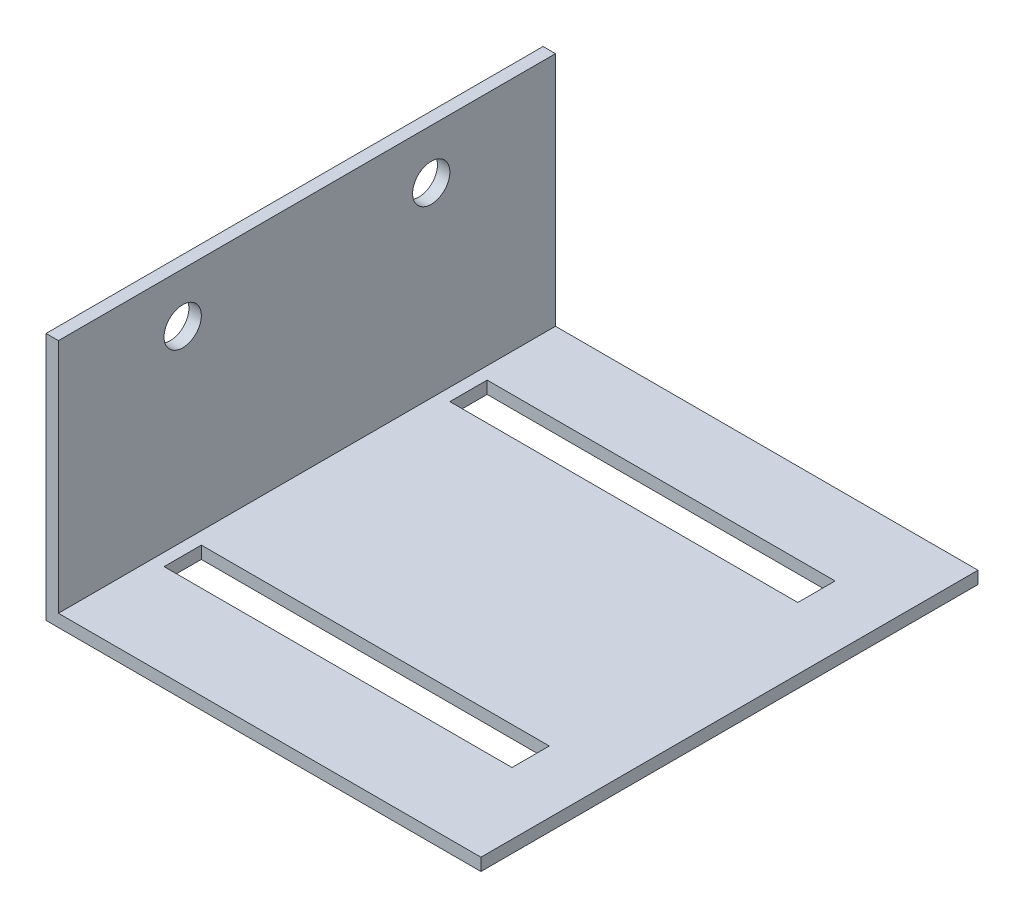
ISO-10303-21;
HEADER;
FILE_DESCRIPTION(('STEP AP214'),'2;1');
FILE_NAME('part.step','',(''),(''),'','','');
FILE_SCHEMA(('AUTOMOTIVE_DESIGN { 1 0 10303 214 1 1 1 1 }'));
ENDSEC;
DATA;
#1=APPLICATION_CONTEXT('core data for automotive mechanical design processes');
#2=APPLICATION_PROTOCOL_DEFINITION('international standard','automotive_design',2000,#1);
#3=PRODUCT_CONTEXT('',#1,'mechanical');
#4=PRODUCT('Part','Part','',(#3));
#5=PRODUCT_RELATED_PRODUCT_CATEGORY('part','',(#4));
#6=PRODUCT_DEFINITION_FORMATION('','',#4);
#7=PRODUCT_DEFINITION_CONTEXT('part definition',#1,'design');
#8=PRODUCT_DEFINITION('design','',#6,#7);
#9=PRODUCT_DEFINITION_SHAPE('','',#8);
#10=(LENGTH_UNIT() NAMED_UNIT(*) SI_UNIT(.MILLI.,.METRE.));
#11=(NAMED_UNIT(*) PLANE_ANGLE_UNIT() SI_UNIT($,.RADIAN.));
#12=(NAMED_UNIT(*) SI_UNIT($,.STERADIAN.) SOLID_ANGLE_UNIT());
#13=UNCERTAINTY_MEASURE_WITH_UNIT(LENGTH_MEASURE(1.E-05),#10,'distance_accuracy_value','');
#14=(GEOMETRIC_REPRESENTATION_CONTEXT(3) GLOBAL_UNCERTAINTY_ASSIGNED_CONTEXT((#13)) GLOBAL_UNIT_ASSIGNED_CONTEXT((#10,
#11,#12)) REPRESENTATION_CONTEXT('',''));
#15=CARTESIAN_POINT('',(0.,0.,0.));
#16=DIRECTION('',(0.,0.,1.));
#17=DIRECTION('',(1.,0.,0.));
#18=AXIS2_PLACEMENT_3D('',#15,#16,#17);
#19=CARTESIAN_POINT('',(0.,20.,40.));
#20=DIRECTION('',(1.,0.,0.));
#21=DIRECTION('',(0.,1.,0.));
#22=AXIS2_PLACEMENT_3D('',#19,#20,#21);
#23=PLANE('',#22);
#24=CARTESIAN_POINT('',(0.,16.,30.));
#25=DIRECTION('',(-1.,0.,0.));
#26=DIRECTION('',(0.,-1.,0.));
#27=AXIS2_PLACEMENT_3D('',#24,#25,#26);
#28=CIRCLE('',#27,1.5);
#29=CARTESIAN_POINT('',(0.,14.5,30.));
#30=VERTEX_POINT('',#29);
#31=EDGE_CURVE('E247',#30,#30,#28,.T.);
#32=ORIENTED_EDGE('',*,*,#31,.F.);
#33=EDGE_LOOP('',(#32));
#34=FACE_BOUND('',#33,.T.);
#35=CARTESIAN_POINT('',(0.,16.,10.));
#36=DIRECTION('',(-1.,0.,0.));
#37=DIRECTION('',(0.,-1.,0.));
#38=AXIS2_PLACEMENT_3D('',#35,#36,#37);
#39=CIRCLE('',#38,1.5);
#40=CARTESIAN_POINT('',(0.,14.5,10.));
#41=VERTEX_POINT('',#40);
#42=EDGE_CURVE('E252',#41,#41,#39,.T.);
#43=ORIENTED_EDGE('',*,*,#42,.F.);
#44=EDGE_LOOP('',(#43));
#45=FACE_BOUND('',#44,.T.);
#46=DIRECTION('',(0.,-1.,0.));
#47=VECTOR('',#46,1.);
#48=CARTESIAN_POINT('',(0.,20.,0.));
#49=LINE('',#48,#47);
#50=CARTESIAN_POINT('',(0.,20.,0.));
#51=VERTEX_POINT('',#50);
#52=CARTESIAN_POINT('',(0.,0.,0.));
#53=VERTEX_POINT('',#52);
#54=EDGE_CURVE('E206',#51,#53,#49,.T.);
#55=ORIENTED_EDGE('',*,*,#54,.T.);
#56=DIRECTION('',(0.,0.,-1.));
#57=VECTOR('',#56,1.);
#58=CARTESIAN_POINT('',(0.,0.,40.));
#59=LINE('',#58,#57);
#60=CARTESIAN_POINT('',(0.,0.,40.));
#61=VERTEX_POINT('',#60);
#62=EDGE_CURVE('E11',#61,#53,#59,.T.);
#63=ORIENTED_EDGE('',*,*,#62,.F.);
#64=DIRECTION('',(0.,-1.,0.));
#65=VECTOR('',#64,1.);
#66=CARTESIAN_POINT('',(0.,20.,40.));
#67=LINE('',#66,#65);
#68=CARTESIAN_POINT('',(0.,20.,40.));
#69=VERTEX_POINT('',#68);
#70=EDGE_CURVE('E207',#69,#61,#67,.T.);
#71=ORIENTED_EDGE('',*,*,#70,.F.);
#72=DIRECTION('',(0.,0.,-1.));
#73=VECTOR('',#72,1.);
#74=CARTESIAN_POINT('',(0.,20.,40.));
#75=LINE('',#74,#73);
#76=EDGE_CURVE('E221',#69,#51,#75,.T.);
#77=ORIENTED_EDGE('',*,*,#76,.T.);
#78=EDGE_LOOP('',(#55,#63,#71,#77));
#79=FACE_BOUND('',#78,.T.);
#80=ADVANCED_FACE('F34',(#34,#45,#79),#23,.F.);
#81=CARTESIAN_POINT('',(0.,0.,40.));
#82=DIRECTION('',(0.,1.,0.));
#83=DIRECTION('',(0.,0.,1.));
#84=AXIS2_PLACEMENT_3D('',#81,#82,#83);
#85=PLANE('',#84);
#86=DIRECTION('',(-1.,0.,0.));
#87=VECTOR('',#86,1.);
#88=CARTESIAN_POINT('',(0.,0.,6.50000000000001));
#89=LINE('',#88,#87);
#90=CARTESIAN_POINT('',(30.,0.,6.50000000000002));
#91=VERTEX_POINT('',#90);
#92=CARTESIAN_POINT('',(2.,0.,6.50000000000002));
#93=VERTEX_POINT('',#92);
#94=EDGE_CURVE('E200',#91,#93,#89,.T.);
#95=ORIENTED_EDGE('',*,*,#94,.T.);
#96=DIRECTION('',(0.,0.,1.));
#97=VECTOR('',#96,1.);
#98=CARTESIAN_POINT('',(2.,0.,40.));
#99=LINE('',#98,#97);
#100=CARTESIAN_POINT('',(2.,0.,9.50000000000002));
#101=VERTEX_POINT('',#100);
#102=EDGE_CURVE('E203',#93,#101,#99,.T.);
#103=ORIENTED_EDGE('',*,*,#102,.T.);
#104=DIRECTION('',(1.,0.,0.));
#105=VECTOR('',#104,1.);
#106=CARTESIAN_POINT('',(0.,0.,9.50000000000002));
#107=LINE('',#106,#105);
#108=CARTESIAN_POINT('',(30.,0.,9.50000000000003));
#109=VERTEX_POINT('',#108);
#110=EDGE_CURVE('E197',#101,#109,#107,.T.);
#111=ORIENTED_EDGE('',*,*,#110,.T.);
#112=DIRECTION('',(0.,0.,-1.));
#113=VECTOR('',#112,1.);
#114=CARTESIAN_POINT('',(30.,0.,40.));
#115=LINE('',#114,#113);
#116=EDGE_CURVE('E141',#109,#91,#115,.T.);
#117=ORIENTED_EDGE('',*,*,#116,.T.);
#118=EDGE_LOOP('',(#95,#103,#111,#117));
#119=FACE_BOUND('',#118,.T.);
#120=DIRECTION('',(-1.,0.,0.));
#121=VECTOR('',#120,1.);
#122=CARTESIAN_POINT('',(0.,0.,29.5));
#123=LINE('',#122,#121);
#124=CARTESIAN_POINT('',(30.,0.,29.5));
#125=VERTEX_POINT('',#124);
#126=CARTESIAN_POINT('',(2.00000000000001,0.,29.5));
#127=VERTEX_POINT('',#126);
#128=EDGE_CURVE('E191',#125,#127,#123,.T.);
#129=ORIENTED_EDGE('',*,*,#128,.T.);
#130=DIRECTION('',(0.,0.,1.));
#131=VECTOR('',#130,1.);
#132=CARTESIAN_POINT('',(2.00000000000001,0.,40.));
#133=LINE('',#132,#131);
#134=CARTESIAN_POINT('',(2.00000000000001,0.,32.5));
#135=VERTEX_POINT('',#134);
#136=EDGE_CURVE('E194',#127,#135,#133,.T.);
#137=ORIENTED_EDGE('',*,*,#136,.T.);
#138=DIRECTION('',(1.,0.,0.));
#139=VECTOR('',#138,1.);
#140=CARTESIAN_POINT('',(0.,0.,32.5));
#141=LINE('',#140,#139);
#142=CARTESIAN_POINT('',(30.,0.,32.5));
#143=VERTEX_POINT('',#142);
#144=EDGE_CURVE('E165',#135,#143,#141,.T.);
#145=ORIENTED_EDGE('',*,*,#144,.T.);
#146=DIRECTION('',(0.,0.,-1.));
#147=VECTOR('',#146,1.);
#148=CARTESIAN_POINT('',(30.,0.,40.));
#149=LINE('',#148,#147);
#150=EDGE_CURVE('E188',#143,#125,#149,.T.);
#151=ORIENTED_EDGE('',*,*,#150,.T.);
#152=EDGE_LOOP('',(#129,#137,#145,#151));
#153=FACE_BOUND('',#152,.T.);
#154=DIRECTION('',(1.,0.,0.));
#155=VECTOR('',#154,1.);
#156=CARTESIAN_POINT('',(0.,0.,0.));
#157=LINE('',#156,#155);
#158=CARTESIAN_POINT('',(35.,0.,0.));
#159=VERTEX_POINT('',#158);
#160=EDGE_CURVE('E224',#53,#159,#157,.T.);
#161=ORIENTED_EDGE('',*,*,#160,.T.);
#162=DIRECTION('',(0.,0.,-1.));
#163=VECTOR('',#162,1.);
#164=CARTESIAN_POINT('',(35.,0.,40.));
#165=LINE('',#164,#163);
#166=CARTESIAN_POINT('',(35.,0.,40.));
#167=VERTEX_POINT('',#166);
#168=EDGE_CURVE('E42',#167,#159,#165,.T.);
#169=ORIENTED_EDGE('',*,*,#168,.F.);
#170=DIRECTION('',(1.,0.,0.));
#171=VECTOR('',#170,1.);
#172=CARTESIAN_POINT('',(0.,0.,40.));
#173=LINE('',#172,#171);
#174=EDGE_CURVE('E210',#61,#167,#173,.T.);
#175=ORIENTED_EDGE('',*,*,#174,.F.);
#176=ORIENTED_EDGE('',*,*,#62,.T.);
#177=EDGE_LOOP('',(#161,#169,#175,#176));
#178=FACE_BOUND('',#177,.T.);
#179=ADVANCED_FACE('F264',(#119,#153,#178),#85,.F.);
#180=CARTESIAN_POINT('',(35.,0.,40.));
#181=DIRECTION('',(-1.,0.,0.));
#182=DIRECTION('',(0.,0.,1.));
#183=AXIS2_PLACEMENT_3D('',#180,#181,#182);
#184=PLANE('',#183);
#185=DIRECTION('',(0.,1.,0.));
#186=VECTOR('',#185,1.);
#187=CARTESIAN_POINT('',(35.,0.,0.));
#188=LINE('',#187,#186);
#189=CARTESIAN_POINT('',(35.,1.,0.));
#190=VERTEX_POINT('',#189);
#191=EDGE_CURVE('E226',#159,#190,#188,.T.);
#192=ORIENTED_EDGE('',*,*,#191,.T.);
#193=DIRECTION('',(0.,0.,-1.));
#194=VECTOR('',#193,1.);
#195=CARTESIAN_POINT('',(35.,1.,40.));
#196=LINE('',#195,#194);
#197=CARTESIAN_POINT('',(35.,1.,40.));
#198=VERTEX_POINT('',#197);
#199=EDGE_CURVE('E241',#198,#190,#196,.T.);
#200=ORIENTED_EDGE('',*,*,#199,.F.);
#201=DIRECTION('',(0.,1.,0.));
#202=VECTOR('',#201,1.);
#203=CARTESIAN_POINT('',(35.,0.,40.));
#204=LINE('',#203,#202);
#205=EDGE_CURVE('E213',#167,#198,#204,.T.);
#206=ORIENTED_EDGE('',*,*,#205,.F.);
#207=ORIENTED_EDGE('',*,*,#168,.T.);
#208=EDGE_LOOP('',(#192,#200,#206,#207));
#209=FACE_BOUND('',#208,.T.);
#210=ADVANCED_FACE('F267',(#209),#184,.F.);
#211=CARTESIAN_POINT('',(35.,1.,40.));
#212=DIRECTION('',(0.,-1.,0.));
#213=DIRECTION('',(1.,0.,0.));
#214=AXIS2_PLACEMENT_3D('',#211,#212,#213);
#215=PLANE('',#214);
#216=DIRECTION('',(1.,0.,0.));
#217=VECTOR('',#216,1.);
#218=CARTESIAN_POINT('',(2.,1.,9.50000000000002));
#219=LINE('',#218,#217);
#220=CARTESIAN_POINT('',(2.,1.,9.50000000000002));
#221=VERTEX_POINT('',#220);
#222=CARTESIAN_POINT('',(30.,1.,9.50000000000003));
#223=VERTEX_POINT('',#222);
#224=EDGE_CURVE('E148',#221,#223,#219,.T.);
#225=ORIENTED_EDGE('',*,*,#224,.F.);
#226=DIRECTION('',(0.,0.,1.));
#227=VECTOR('',#226,1.);
#228=CARTESIAN_POINT('',(2.,1.,6.50000000000002));
#229=LINE('',#228,#227);
#230=CARTESIAN_POINT('',(2.,1.,6.50000000000002));
#231=VERTEX_POINT('',#230);
#232=EDGE_CURVE('E153',#231,#221,#229,.T.);
#233=ORIENTED_EDGE('',*,*,#232,.F.);
#234=DIRECTION('',(-1.,0.,0.));
#235=VECTOR('',#234,1.);
#236=CARTESIAN_POINT('',(2.,1.,6.50000000000002));
#237=LINE('',#236,#235);
#238=CARTESIAN_POINT('',(30.,1.,6.50000000000002));
#239=VERTEX_POINT('',#238);
#240=EDGE_CURVE('E158',#239,#231,#237,.T.);
#241=ORIENTED_EDGE('',*,*,#240,.F.);
#242=DIRECTION('',(0.,0.,-1.));
#243=VECTOR('',#242,1.);
#244=CARTESIAN_POINT('',(30.,1.,6.50000000000002));
#245=LINE('',#244,#243);
#246=EDGE_CURVE('E138',#223,#239,#245,.T.);
#247=ORIENTED_EDGE('',*,*,#246,.F.);
#248=EDGE_LOOP('',(#225,#233,#241,#247));
#249=FACE_BOUND('',#248,.T.);
#250=DIRECTION('',(1.,0.,0.));
#251=VECTOR('',#250,1.);
#252=CARTESIAN_POINT('',(2.00000000000001,1.,32.5));
#253=LINE('',#252,#251);
#254=CARTESIAN_POINT('',(2.00000000000001,1.,32.5));
#255=VERTEX_POINT('',#254);
#256=CARTESIAN_POINT('',(30.,1.,32.5));
#257=VERTEX_POINT('',#256);
#258=EDGE_CURVE('E170',#255,#257,#253,.T.);
#259=ORIENTED_EDGE('',*,*,#258,.F.);
#260=DIRECTION('',(0.,0.,1.));
#261=VECTOR('',#260,1.);
#262=CARTESIAN_POINT('',(2.00000000000001,1.,32.5));
#263=LINE('',#262,#261);
#264=CARTESIAN_POINT('',(2.00000000000001,1.,29.5));
#265=VERTEX_POINT('',#264);
#266=EDGE_CURVE('E168',#265,#255,#263,.T.);
#267=ORIENTED_EDGE('',*,*,#266,.F.);
#268=DIRECTION('',(-1.,0.,0.));
#269=VECTOR('',#268,1.);
#270=CARTESIAN_POINT('',(2.00000000000001,1.,29.5));
#271=LINE('',#270,#269);
#272=CARTESIAN_POINT('',(30.,1.,29.5));
#273=VERTEX_POINT('',#272);
#274=EDGE_CURVE('E175',#273,#265,#271,.T.);
#275=ORIENTED_EDGE('',*,*,#274,.F.);
#276=DIRECTION('',(0.,0.,-1.));
#277=VECTOR('',#276,1.);
#278=CARTESIAN_POINT('',(30.,1.,32.5));
#279=LINE('',#278,#277);
#280=EDGE_CURVE('E172',#257,#273,#279,.T.);
#281=ORIENTED_EDGE('',*,*,#280,.F.);
#282=EDGE_LOOP('',(#259,#267,#275,#281));
#283=FACE_BOUND('',#282,.T.);
#284=DIRECTION('',(-1.,0.,0.));
#285=VECTOR('',#284,1.);
#286=CARTESIAN_POINT('',(35.,1.,0.));
#287=LINE('',#286,#285);
#288=CARTESIAN_POINT('',(1.00000000000001,1.,0.));
#289=VERTEX_POINT('',#288);
#290=EDGE_CURVE('E228',#190,#289,#287,.T.);
#291=ORIENTED_EDGE('',*,*,#290,.T.);
#292=DIRECTION('',(0.,0.,-1.));
#293=VECTOR('',#292,1.);
#294=CARTESIAN_POINT('',(1.00000000000001,1.,40.));
#295=LINE('',#294,#293);
#296=CARTESIAN_POINT('',(1.00000000000001,1.,40.));
#297=VERTEX_POINT('',#296);
#298=EDGE_CURVE('E238',#297,#289,#295,.T.);
#299=ORIENTED_EDGE('',*,*,#298,.F.);
#300=DIRECTION('',(-1.,0.,0.));
#301=VECTOR('',#300,1.);
#302=CARTESIAN_POINT('',(35.,1.,40.));
#303=LINE('',#302,#301);
#304=EDGE_CURVE('E215',#198,#297,#303,.T.);
#305=ORIENTED_EDGE('',*,*,#304,.F.);
#306=ORIENTED_EDGE('',*,*,#199,.T.);
#307=EDGE_LOOP('',(#291,#299,#305,#306));
#308=FACE_BOUND('',#307,.T.);
#309=ADVANCED_FACE('F155',(#249,#283,#308),#215,.F.);
#310=CARTESIAN_POINT('',(1.00000000000001,1.,40.));
#311=DIRECTION('',(-1.,0.,0.));
#312=DIRECTION('',(0.,-1.,0.));
#313=AXIS2_PLACEMENT_3D('',#310,#311,#312);
#314=PLANE('',#313);
#315=CARTESIAN_POINT('',(1.00000000000001,16.,30.));
#316=DIRECTION('',(-1.,0.,0.));
#317=DIRECTION('',(0.,-1.,0.));
#318=AXIS2_PLACEMENT_3D('',#315,#316,#317);
#319=CIRCLE('',#318,1.5);
#320=CARTESIAN_POINT('',(1.00000000000001,14.5,30.));
#321=VERTEX_POINT('',#320);
#322=EDGE_CURVE('E37',#321,#321,#319,.T.);
#323=ORIENTED_EDGE('',*,*,#322,.T.);
#324=EDGE_LOOP('',(#323));
#325=FACE_BOUND('',#324,.T.);
#326=CARTESIAN_POINT('',(1.00000000000001,16.,10.));
#327=DIRECTION('',(-1.,0.,0.));
#328=DIRECTION('',(0.,-1.,0.));
#329=AXIS2_PLACEMENT_3D('',#326,#327,#328);
#330=CIRCLE('',#329,1.5);
#331=CARTESIAN_POINT('',(1.00000000000001,14.5,10.));
#332=VERTEX_POINT('',#331);
#333=EDGE_CURVE('E245',#332,#332,#330,.T.);
#334=ORIENTED_EDGE('',*,*,#333,.T.);
#335=EDGE_LOOP('',(#334));
#336=FACE_BOUND('',#335,.T.);
#337=DIRECTION('',(0.,1.,0.));
#338=VECTOR('',#337,1.);
#339=CARTESIAN_POINT('',(1.00000000000001,1.,0.));
#340=LINE('',#339,#338);
#341=CARTESIAN_POINT('',(1.00000000000001,20.,0.));
#342=VERTEX_POINT('',#341);
#343=EDGE_CURVE('E230',#289,#342,#340,.T.);
#344=ORIENTED_EDGE('',*,*,#343,.T.);
#345=DIRECTION('',(0.,0.,-1.));
#346=VECTOR('',#345,1.);
#347=CARTESIAN_POINT('',(1.00000000000001,20.,40.));
#348=LINE('',#347,#346);
#349=CARTESIAN_POINT('',(1.00000000000001,20.,40.));
#350=VERTEX_POINT('',#349);
#351=EDGE_CURVE('E235',#350,#342,#348,.T.);
#352=ORIENTED_EDGE('',*,*,#351,.F.);
#353=DIRECTION('',(0.,1.,0.));
#354=VECTOR('',#353,1.);
#355=CARTESIAN_POINT('',(1.00000000000001,1.,40.));
#356=LINE('',#355,#354);
#357=EDGE_CURVE('E217',#297,#350,#356,.T.);
#358=ORIENTED_EDGE('',*,*,#357,.F.);
#359=ORIENTED_EDGE('',*,*,#298,.T.);
#360=EDGE_LOOP('',(#344,#352,#358,#359));
#361=FACE_BOUND('',#360,.T.);
#362=ADVANCED_FACE('F286',(#325,#336,#361),#314,.F.);
#363=CARTESIAN_POINT('',(1.00000000000001,20.,40.));
#364=DIRECTION('',(0.,-1.,0.));
#365=DIRECTION('',(0.,0.,-1.));
#366=AXIS2_PLACEMENT_3D('',#363,#364,#365);
#367=PLANE('',#366);
#368=DIRECTION('',(-1.,0.,0.));
#369=VECTOR('',#368,1.);
#370=CARTESIAN_POINT('',(1.00000000000001,20.,0.));
#371=LINE('',#370,#369);
#372=EDGE_CURVE('E211',#342,#51,#371,.T.);
#373=ORIENTED_EDGE('',*,*,#372,.T.);
#374=ORIENTED_EDGE('',*,*,#76,.F.);
#375=DIRECTION('',(-1.,0.,0.));
#376=VECTOR('',#375,1.);
#377=CARTESIAN_POINT('',(1.00000000000001,20.,40.));
#378=LINE('',#377,#376);
#379=EDGE_CURVE('E219',#350,#69,#378,.T.);
#380=ORIENTED_EDGE('',*,*,#379,.F.);
#381=ORIENTED_EDGE('',*,*,#351,.T.);
#382=EDGE_LOOP('',(#373,#374,#380,#381));
#383=FACE_BOUND('',#382,.T.);
#384=ADVANCED_FACE('F295',(#383),#367,.F.);
#385=CARTESIAN_POINT('',(0.,0.,40.));
#386=DIRECTION('',(0.,0.,1.));
#387=DIRECTION('',(1.,0.,0.));
#388=AXIS2_PLACEMENT_3D('',#385,#386,#387);
#389=PLANE('',#388);
#390=ORIENTED_EDGE('',*,*,#70,.T.);
#391=ORIENTED_EDGE('',*,*,#174,.T.);
#392=ORIENTED_EDGE('',*,*,#205,.T.);
#393=ORIENTED_EDGE('',*,*,#304,.T.);
#394=ORIENTED_EDGE('',*,*,#357,.T.);
#395=ORIENTED_EDGE('',*,*,#379,.T.);
#396=EDGE_LOOP('',(#390,#391,#392,#393,#394,#395));
#397=FACE_BOUND('',#396,.T.);
#398=ADVANCED_FACE('F290',(#397),#389,.T.);
#399=CARTESIAN_POINT('',(0.,0.,0.));
#400=DIRECTION('',(0.,0.,1.));
#401=DIRECTION('',(1.,0.,0.));
#402=AXIS2_PLACEMENT_3D('',#399,#400,#401);
#403=PLANE('',#402);
#404=ORIENTED_EDGE('',*,*,#54,.F.);
#405=ORIENTED_EDGE('',*,*,#372,.F.);
#406=ORIENTED_EDGE('',*,*,#343,.F.);
#407=ORIENTED_EDGE('',*,*,#290,.F.);
#408=ORIENTED_EDGE('',*,*,#191,.F.);
#409=ORIENTED_EDGE('',*,*,#160,.F.);
#410=EDGE_LOOP('',(#404,#405,#406,#407,#408,#409));
#411=FACE_BOUND('',#410,.T.);
#412=ADVANCED_FACE('F278',(#411),#403,.F.);
#413=CARTESIAN_POINT('',(2.00000000000001,-9.,32.5));
#414=DIRECTION('',(-1.,0.,0.));
#415=DIRECTION('',(0.,0.,1.));
#416=AXIS2_PLACEMENT_3D('',#413,#414,#415);
#417=PLANE('',#416);
#418=DIRECTION('',(0.,1.,0.));
#419=VECTOR('',#418,1.);
#420=CARTESIAN_POINT('',(2.00000000000001,-9.,29.5));
#421=LINE('',#420,#419);
#422=EDGE_CURVE('E179',#127,#265,#421,.T.);
#423=ORIENTED_EDGE('',*,*,#422,.T.);
#424=ORIENTED_EDGE('',*,*,#266,.T.);
#425=DIRECTION('',(0.,1.,0.));
#426=VECTOR('',#425,1.);
#427=CARTESIAN_POINT('',(2.00000000000001,-9.,32.5));
#428=LINE('',#427,#426);
#429=EDGE_CURVE('E178',#135,#255,#428,.T.);
#430=ORIENTED_EDGE('',*,*,#429,.F.);
#431=ORIENTED_EDGE('',*,*,#136,.F.);
#432=EDGE_LOOP('',(#423,#424,#430,#431));
#433=FACE_BOUND('',#432,.T.);
#434=ADVANCED_FACE('F336',(#433),#417,.F.);
#435=CARTESIAN_POINT('',(2.00000000000001,-9.,29.5));
#436=DIRECTION('',(0.,0.,-1.));
#437=DIRECTION('',(-1.,0.,0.));
#438=AXIS2_PLACEMENT_3D('',#435,#436,#437);
#439=PLANE('',#438);
#440=DIRECTION('',(0.,1.,0.));
#441=VECTOR('',#440,1.);
#442=CARTESIAN_POINT('',(30.,-9.,29.5));
#443=LINE('',#442,#441);
#444=EDGE_CURVE('E181',#125,#273,#443,.T.);
#445=ORIENTED_EDGE('',*,*,#444,.T.);
#446=ORIENTED_EDGE('',*,*,#274,.T.);
#447=ORIENTED_EDGE('',*,*,#422,.F.);
#448=ORIENTED_EDGE('',*,*,#128,.F.);
#449=EDGE_LOOP('',(#445,#446,#447,#448));
#450=FACE_BOUND('',#449,.T.);
#451=ADVANCED_FACE('F332',(#450),#439,.F.);
#452=CARTESIAN_POINT('',(30.,-9.,32.5));
#453=DIRECTION('',(1.,0.,0.));
#454=DIRECTION('',(0.,0.,-1.));
#455=AXIS2_PLACEMENT_3D('',#452,#453,#454);
#456=PLANE('',#455);
#457=DIRECTION('',(0.,1.,0.));
#458=VECTOR('',#457,1.);
#459=CARTESIAN_POINT('',(30.,-9.,32.5));
#460=LINE('',#459,#458);
#461=EDGE_CURVE('E58',#143,#257,#460,.T.);
#462=ORIENTED_EDGE('',*,*,#461,.T.);
#463=ORIENTED_EDGE('',*,*,#280,.T.);
#464=ORIENTED_EDGE('',*,*,#444,.F.);
#465=ORIENTED_EDGE('',*,*,#150,.F.);
#466=EDGE_LOOP('',(#462,#463,#464,#465));
#467=FACE_BOUND('',#466,.T.);
#468=ADVANCED_FACE('F335',(#467),#456,.F.);
#469=CARTESIAN_POINT('',(2.00000000000001,-9.,32.5));
#470=DIRECTION('',(0.,0.,1.));
#471=DIRECTION('',(1.,0.,0.));
#472=AXIS2_PLACEMENT_3D('',#469,#470,#471);
#473=PLANE('',#472);
#474=ORIENTED_EDGE('',*,*,#429,.T.);
#475=ORIENTED_EDGE('',*,*,#258,.T.);
#476=ORIENTED_EDGE('',*,*,#461,.F.);
#477=ORIENTED_EDGE('',*,*,#144,.F.);
#478=EDGE_LOOP('',(#474,#475,#476,#477));
#479=FACE_BOUND('',#478,.T.);
#480=ADVANCED_FACE('F331',(#479),#473,.F.);
#481=CARTESIAN_POINT('',(2.,-9.,6.50000000000002));
#482=DIRECTION('',(-1.,0.,0.));
#483=DIRECTION('',(0.,0.,1.));
#484=AXIS2_PLACEMENT_3D('',#481,#482,#483);
#485=PLANE('',#484);
#486=DIRECTION('',(0.,1.,0.));
#487=VECTOR('',#486,1.);
#488=CARTESIAN_POINT('',(2.,-9.,6.50000000000002));
#489=LINE('',#488,#487);
#490=EDGE_CURVE('E163',#93,#231,#489,.T.);
#491=ORIENTED_EDGE('',*,*,#490,.T.);
#492=ORIENTED_EDGE('',*,*,#232,.T.);
#493=DIRECTION('',(0.,1.,0.));
#494=VECTOR('',#493,1.);
#495=CARTESIAN_POINT('',(2.,-9.,9.50000000000002));
#496=LINE('',#495,#494);
#497=EDGE_CURVE('E144',#101,#221,#496,.T.);
#498=ORIENTED_EDGE('',*,*,#497,.F.);
#499=ORIENTED_EDGE('',*,*,#102,.F.);
#500=EDGE_LOOP('',(#491,#492,#498,#499));
#501=FACE_BOUND('',#500,.T.);
#502=ADVANCED_FACE('F259',(#501),#485,.F.);
#503=CARTESIAN_POINT('',(2.,-9.,6.50000000000002));
#504=DIRECTION('',(0.,0.,-1.));
#505=DIRECTION('',(-1.,0.,0.));
#506=AXIS2_PLACEMENT_3D('',#503,#504,#505);
#507=PLANE('',#506);
#508=DIRECTION('',(0.,1.,0.));
#509=VECTOR('',#508,1.);
#510=CARTESIAN_POINT('',(30.,-9.,6.50000000000002));
#511=LINE('',#510,#509);
#512=EDGE_CURVE('E143',#91,#239,#511,.T.);
#513=ORIENTED_EDGE('',*,*,#512,.T.);
#514=ORIENTED_EDGE('',*,*,#240,.T.);
#515=ORIENTED_EDGE('',*,*,#490,.F.);
#516=ORIENTED_EDGE('',*,*,#94,.F.);
#517=EDGE_LOOP('',(#513,#514,#515,#516));
#518=FACE_BOUND('',#517,.T.);
#519=ADVANCED_FACE('F262',(#518),#507,.F.);
#520=CARTESIAN_POINT('',(30.,-9.,6.50000000000002));
#521=DIRECTION('',(1.,0.,0.));
#522=DIRECTION('',(0.,0.,-1.));
#523=AXIS2_PLACEMENT_3D('',#520,#521,#522);
#524=PLANE('',#523);
#525=DIRECTION('',(0.,1.,0.));
#526=VECTOR('',#525,1.);
#527=CARTESIAN_POINT('',(30.,-9.,9.50000000000003));
#528=LINE('',#527,#526);
#529=EDGE_CURVE('E50',#109,#223,#528,.T.);
#530=ORIENTED_EDGE('',*,*,#529,.T.);
#531=ORIENTED_EDGE('',*,*,#246,.T.);
#532=ORIENTED_EDGE('',*,*,#512,.F.);
#533=ORIENTED_EDGE('',*,*,#116,.F.);
#534=EDGE_LOOP('',(#530,#531,#532,#533));
#535=FACE_BOUND('',#534,.T.);
#536=ADVANCED_FACE('F135',(#535),#524,.F.);
#537=CARTESIAN_POINT('',(2.,-9.,9.50000000000002));
#538=DIRECTION('',(0.,0.,1.));
#539=DIRECTION('',(1.,0.,0.));
#540=AXIS2_PLACEMENT_3D('',#537,#538,#539);
#541=PLANE('',#540);
#542=ORIENTED_EDGE('',*,*,#497,.T.);
#543=ORIENTED_EDGE('',*,*,#224,.T.);
#544=ORIENTED_EDGE('',*,*,#529,.F.);
#545=ORIENTED_EDGE('',*,*,#110,.F.);
#546=EDGE_LOOP('',(#542,#543,#544,#545));
#547=FACE_BOUND('',#546,.T.);
#548=ADVANCED_FACE('F149',(#547),#541,.F.);
#549=CARTESIAN_POINT('',(10.,16.,10.));
#550=DIRECTION('',(-1.,0.,0.));
#551=DIRECTION('',(0.,-1.,0.));
#552=AXIS2_PLACEMENT_3D('',#549,#550,#551);
#553=CYLINDRICAL_SURFACE('',#552,1.5);
#554=ORIENTED_EDGE('',*,*,#42,.T.);
#555=EDGE_LOOP('',(#554));
#556=FACE_BOUND('',#555,.T.);
#557=ORIENTED_EDGE('',*,*,#333,.F.);
#558=EDGE_LOOP('',(#557));
#559=FACE_BOUND('',#558,.T.);
#560=ADVANCED_FACE('F313',(#556,#559),#553,.F.);
#561=CARTESIAN_POINT('',(10.,16.,30.));
#562=DIRECTION('',(-1.,0.,0.));
#563=DIRECTION('',(0.,-1.,0.));
#564=AXIS2_PLACEMENT_3D('',#561,#562,#563);
#565=CYLINDRICAL_SURFACE('',#564,1.5);
#566=ORIENTED_EDGE('',*,*,#31,.T.);
#567=EDGE_LOOP('',(#566));
#568=FACE_BOUND('',#567,.T.);
#569=ORIENTED_EDGE('',*,*,#322,.F.);
#570=EDGE_LOOP('',(#569));
#571=FACE_BOUND('',#570,.T.);
#572=ADVANCED_FACE('F316',(#568,#571),#565,.F.);
#573=CLOSED_SHELL('',(#80,#179,#210,#309,#362,#384,#398,#412,#434,#451,#468,#480,#502,#519,#536,
#548,#560,#572));
#574=MANIFOLD_SOLID_BREP('B2',#573);
#575=ADVANCED_BREP_SHAPE_REPRESENTATION('',(#18,#574),#14);
#576=SHAPE_DEFINITION_REPRESENTATION(#9,#575);
ENDSEC;
END-ISO-10303-21;
